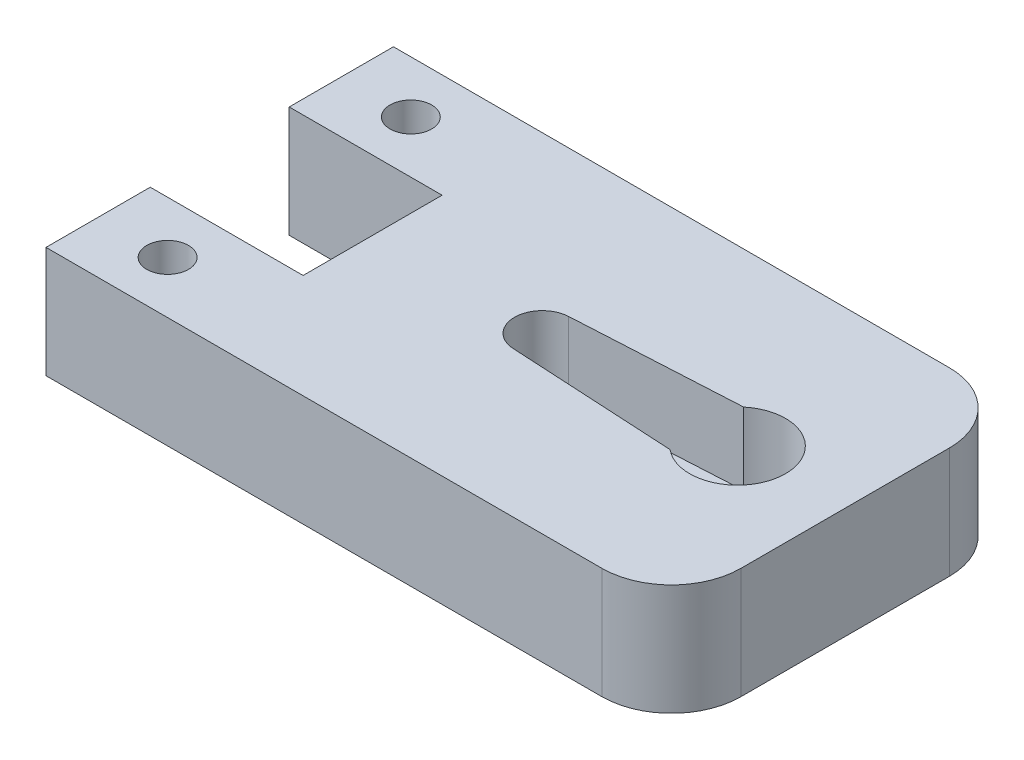
ISO-10303-21;
HEADER;
FILE_DESCRIPTION(('STEP AP214'),'2;1');
FILE_NAME('part.step','',(''),(''),'','','');
FILE_SCHEMA(('AUTOMOTIVE_DESIGN { 1 0 10303 214 1 1 1 1 }'));
ENDSEC;
DATA;
#1=APPLICATION_CONTEXT('core data for automotive mechanical design processes');
#2=APPLICATION_PROTOCOL_DEFINITION('international standard','automotive_design',2000,#1);
#3=PRODUCT_CONTEXT('',#1,'mechanical');
#4=PRODUCT('Part','Part','',(#3));
#5=PRODUCT_RELATED_PRODUCT_CATEGORY('part','',(#4));
#6=PRODUCT_DEFINITION_FORMATION('','',#4);
#7=PRODUCT_DEFINITION_CONTEXT('part definition',#1,'design');
#8=PRODUCT_DEFINITION('design','',#6,#7);
#9=PRODUCT_DEFINITION_SHAPE('','',#8);
#10=(LENGTH_UNIT() NAMED_UNIT(*) SI_UNIT(.MILLI.,.METRE.));
#11=(NAMED_UNIT(*) PLANE_ANGLE_UNIT() SI_UNIT($,.RADIAN.));
#12=(NAMED_UNIT(*) SI_UNIT($,.STERADIAN.) SOLID_ANGLE_UNIT());
#13=UNCERTAINTY_MEASURE_WITH_UNIT(LENGTH_MEASURE(1.E-05),#10,'distance_accuracy_value','');
#14=(GEOMETRIC_REPRESENTATION_CONTEXT(3) GLOBAL_UNCERTAINTY_ASSIGNED_CONTEXT((#13)) GLOBAL_UNIT_ASSIGNED_CONTEXT((#10,
#11,#12)) REPRESENTATION_CONTEXT('',''));
#15=CARTESIAN_POINT('',(0.,0.,0.));
#16=DIRECTION('',(0.,0.,1.));
#17=DIRECTION('',(1.,0.,0.));
#18=AXIS2_PLACEMENT_3D('',#15,#16,#17);
#19=CARTESIAN_POINT('',(0.,8.,-5.00000000000003));
#20=DIRECTION('',(1.,0.,0.));
#21=DIRECTION('',(0.,0.,-1.));
#22=AXIS2_PLACEMENT_3D('',#19,#20,#21);
#23=PLANE('',#22);
#24=DIRECTION('',(0.,0.,1.));
#25=VECTOR('',#24,1.);
#26=CARTESIAN_POINT('',(0.,0.,-5.00000000000003));
#27=LINE('',#26,#25);
#28=CARTESIAN_POINT('',(0.,0.,-25.));
#29=VERTEX_POINT('',#28);
#30=CARTESIAN_POINT('',(0.,0.,-17.5));
#31=VERTEX_POINT('',#30);
#32=EDGE_CURVE('E163',#29,#31,#27,.T.);
#33=ORIENTED_EDGE('',*,*,#32,.T.);
#34=DIRECTION('',(0.,1.,0.));
#35=VECTOR('',#34,1.);
#36=CARTESIAN_POINT('',(0.,0.,-17.5));
#37=LINE('',#36,#35);
#38=CARTESIAN_POINT('',(0.,8.,-17.5));
#39=VERTEX_POINT('',#38);
#40=EDGE_CURVE('E217',#31,#39,#37,.T.);
#41=ORIENTED_EDGE('',*,*,#40,.T.);
#42=DIRECTION('',(0.,0.,1.));
#43=VECTOR('',#42,1.);
#44=CARTESIAN_POINT('',(0.,8.,-25.));
#45=LINE('',#44,#43);
#46=CARTESIAN_POINT('',(0.,8.,-25.));
#47=VERTEX_POINT('',#46);
#48=EDGE_CURVE('E195',#47,#39,#45,.T.);
#49=ORIENTED_EDGE('',*,*,#48,.F.);
#50=DIRECTION('',(0.,-1.,0.));
#51=VECTOR('',#50,1.);
#52=CARTESIAN_POINT('',(0.,8.,-25.));
#53=LINE('',#52,#51);
#54=EDGE_CURVE('E47',#47,#29,#53,.T.);
#55=ORIENTED_EDGE('',*,*,#54,.T.);
#56=EDGE_LOOP('',(#33,#41,#49,#55));
#57=FACE_BOUND('',#56,.T.);
#58=ADVANCED_FACE('F39',(#57),#23,.F.);
#59=CARTESIAN_POINT('',(40.,8.,-20.));
#60=DIRECTION('',(0.,-1.,0.));
#61=DIRECTION('',(0.,0.,-1.));
#62=AXIS2_PLACEMENT_3D('',#59,#60,#61);
#63=CYLINDRICAL_SURFACE('',#62,5.);
#64=CARTESIAN_POINT('',(40.,0.,-20.));
#65=DIRECTION('',(0.,1.,0.));
#66=DIRECTION('',(0.,0.,1.));
#67=AXIS2_PLACEMENT_3D('',#64,#65,#66);
#68=CIRCLE('',#67,5.);
#69=CARTESIAN_POINT('',(45.,0.,-20.));
#70=VERTEX_POINT('',#69);
#71=CARTESIAN_POINT('',(40.,0.,-25.));
#72=VERTEX_POINT('',#71);
#73=EDGE_CURVE('E168',#70,#72,#68,.T.);
#74=ORIENTED_EDGE('',*,*,#73,.T.);
#75=DIRECTION('',(0.,-1.,0.));
#76=VECTOR('',#75,1.);
#77=CARTESIAN_POINT('',(40.,8.,-25.));
#78=LINE('',#77,#76);
#79=CARTESIAN_POINT('',(40.,8.,-25.));
#80=VERTEX_POINT('',#79);
#81=EDGE_CURVE('E11',#80,#72,#78,.T.);
#82=ORIENTED_EDGE('',*,*,#81,.F.);
#83=CARTESIAN_POINT('',(40.,8.,-20.));
#84=DIRECTION('',(0.,1.,0.));
#85=DIRECTION('',(0.,0.,1.));
#86=AXIS2_PLACEMENT_3D('',#83,#84,#85);
#87=CIRCLE('',#86,5.);
#88=CARTESIAN_POINT('',(45.,8.,-20.));
#89=VERTEX_POINT('',#88);
#90=EDGE_CURVE('E177',#89,#80,#87,.T.);
#91=ORIENTED_EDGE('',*,*,#90,.F.);
#92=DIRECTION('',(0.,-1.,0.));
#93=VECTOR('',#92,1.);
#94=CARTESIAN_POINT('',(45.,8.,-20.));
#95=LINE('',#94,#93);
#96=EDGE_CURVE('E178',#89,#70,#95,.T.);
#97=ORIENTED_EDGE('',*,*,#96,.T.);
#98=EDGE_LOOP('',(#74,#82,#91,#97));
#99=FACE_BOUND('',#98,.T.);
#100=ADVANCED_FACE('F41',(#99),#63,.T.);
#101=CARTESIAN_POINT('',(5.00000000000004,8.,-25.));
#102=DIRECTION('',(0.,0.,1.));
#103=DIRECTION('',(1.,0.,0.));
#104=AXIS2_PLACEMENT_3D('',#101,#102,#103);
#105=PLANE('',#104);
#106=DIRECTION('',(-1.,0.,0.));
#107=VECTOR('',#106,1.);
#108=CARTESIAN_POINT('',(5.00000000000004,0.,-25.));
#109=LINE('',#108,#107);
#110=EDGE_CURVE('E164',#72,#29,#109,.T.);
#111=ORIENTED_EDGE('',*,*,#110,.T.);
#112=ORIENTED_EDGE('',*,*,#54,.F.);
#113=DIRECTION('',(-1.,0.,0.));
#114=VECTOR('',#113,1.);
#115=CARTESIAN_POINT('',(5.00000000000004,8.,-25.));
#116=LINE('',#115,#114);
#117=EDGE_CURVE('E198',#80,#47,#116,.T.);
#118=ORIENTED_EDGE('',*,*,#117,.F.);
#119=ORIENTED_EDGE('',*,*,#81,.T.);
#120=EDGE_LOOP('',(#111,#112,#118,#119));
#121=FACE_BOUND('',#120,.T.);
#122=ADVANCED_FACE('F197',(#121),#105,.F.);
#123=CARTESIAN_POINT('',(0.,8.,-7.5));
#124=VERTEX_POINT('',#123);
#125=CARTESIAN_POINT('',(0.,8.,0.));
#126=VERTEX_POINT('',#125);
#127=EDGE_CURVE('E156',#124,#126,#45,.T.);
#128=ORIENTED_EDGE('',*,*,#127,.F.);
#129=DIRECTION('',(0.,1.,0.));
#130=VECTOR('',#129,1.);
#131=CARTESIAN_POINT('',(0.,0.,-7.5));
#132=LINE('',#131,#130);
#133=CARTESIAN_POINT('',(0.,0.,-7.5));
#134=VERTEX_POINT('',#133);
#135=EDGE_CURVE('E143',#134,#124,#132,.T.);
#136=ORIENTED_EDGE('',*,*,#135,.F.);
#137=CARTESIAN_POINT('',(0.,0.,0.));
#138=VERTEX_POINT('',#137);
#139=EDGE_CURVE('E154',#134,#138,#27,.T.);
#140=ORIENTED_EDGE('',*,*,#139,.T.);
#141=DIRECTION('',(0.,-1.,0.));
#142=VECTOR('',#141,1.);
#143=CARTESIAN_POINT('',(0.,8.,0.));
#144=LINE('',#143,#142);
#145=EDGE_CURVE('E188',#126,#138,#144,.T.);
#146=ORIENTED_EDGE('',*,*,#145,.F.);
#147=EDGE_LOOP('',(#128,#136,#140,#146));
#148=FACE_BOUND('',#147,.T.);
#149=ADVANCED_FACE('F152',(#148),#23,.F.);
#150=CARTESIAN_POINT('',(5.00000000000003,8.,0.));
#151=DIRECTION('',(0.,0.,-1.));
#152=DIRECTION('',(-1.,0.,0.));
#153=AXIS2_PLACEMENT_3D('',#150,#151,#152);
#154=PLANE('',#153);
#155=DIRECTION('',(1.,0.,0.));
#156=VECTOR('',#155,1.);
#157=CARTESIAN_POINT('',(5.00000000000003,0.,0.));
#158=LINE('',#157,#156);
#159=CARTESIAN_POINT('',(40.,0.,0.));
#160=VERTEX_POINT('',#159);
#161=EDGE_CURVE('E161',#138,#160,#158,.T.);
#162=ORIENTED_EDGE('',*,*,#161,.T.);
#163=DIRECTION('',(0.,-1.,0.));
#164=VECTOR('',#163,1.);
#165=CARTESIAN_POINT('',(40.,8.,0.));
#166=LINE('',#165,#164);
#167=CARTESIAN_POINT('',(40.,8.,0.));
#168=VERTEX_POINT('',#167);
#169=EDGE_CURVE('E185',#168,#160,#166,.T.);
#170=ORIENTED_EDGE('',*,*,#169,.F.);
#171=DIRECTION('',(1.,0.,0.));
#172=VECTOR('',#171,1.);
#173=CARTESIAN_POINT('',(0.,8.,0.));
#174=LINE('',#173,#172);
#175=EDGE_CURVE('E267',#126,#168,#174,.T.);
#176=ORIENTED_EDGE('',*,*,#175,.F.);
#177=ORIENTED_EDGE('',*,*,#145,.T.);
#178=EDGE_LOOP('',(#162,#170,#176,#177));
#179=FACE_BOUND('',#178,.T.);
#180=ADVANCED_FACE('F284',(#179),#154,.F.);
#181=CARTESIAN_POINT('',(40.,8.,-5.));
#182=DIRECTION('',(0.,-1.,0.));
#183=DIRECTION('',(0.,0.,-1.));
#184=AXIS2_PLACEMENT_3D('',#181,#182,#183);
#185=CYLINDRICAL_SURFACE('',#184,5.);
#186=CARTESIAN_POINT('',(40.,0.,-5.));
#187=DIRECTION('',(0.,1.,0.));
#188=DIRECTION('',(0.,0.,1.));
#189=AXIS2_PLACEMENT_3D('',#186,#187,#188);
#190=CIRCLE('',#189,5.);
#191=CARTESIAN_POINT('',(45.,0.,-5.));
#192=VERTEX_POINT('',#191);
#193=EDGE_CURVE('E173',#160,#192,#190,.T.);
#194=ORIENTED_EDGE('',*,*,#193,.T.);
#195=DIRECTION('',(0.,-1.,0.));
#196=VECTOR('',#195,1.);
#197=CARTESIAN_POINT('',(45.,8.,-5.));
#198=LINE('',#197,#196);
#199=CARTESIAN_POINT('',(45.,8.,-5.));
#200=VERTEX_POINT('',#199);
#201=EDGE_CURVE('E181',#200,#192,#198,.T.);
#202=ORIENTED_EDGE('',*,*,#201,.F.);
#203=CARTESIAN_POINT('',(40.,8.,-5.));
#204=DIRECTION('',(0.,1.,0.));
#205=DIRECTION('',(0.,0.,1.));
#206=AXIS2_PLACEMENT_3D('',#203,#204,#205);
#207=CIRCLE('',#206,5.);
#208=EDGE_CURVE('E269',#168,#200,#207,.T.);
#209=ORIENTED_EDGE('',*,*,#208,.F.);
#210=ORIENTED_EDGE('',*,*,#169,.T.);
#211=EDGE_LOOP('',(#194,#202,#209,#210));
#212=FACE_BOUND('',#211,.T.);
#213=ADVANCED_FACE('F279',(#212),#185,.T.);
#214=CARTESIAN_POINT('',(45.,8.,-5.));
#215=DIRECTION('',(-1.,0.,0.));
#216=DIRECTION('',(0.,0.,1.));
#217=AXIS2_PLACEMENT_3D('',#214,#215,#216);
#218=PLANE('',#217);
#219=DIRECTION('',(0.,0.,-1.));
#220=VECTOR('',#219,1.);
#221=CARTESIAN_POINT('',(45.,0.,-5.));
#222=LINE('',#221,#220);
#223=EDGE_CURVE('E175',#192,#70,#222,.T.);
#224=ORIENTED_EDGE('',*,*,#223,.T.);
#225=ORIENTED_EDGE('',*,*,#96,.F.);
#226=DIRECTION('',(0.,0.,-1.));
#227=VECTOR('',#226,1.);
#228=CARTESIAN_POINT('',(45.,8.,-5.));
#229=LINE('',#228,#227);
#230=EDGE_CURVE('E182',#200,#89,#229,.T.);
#231=ORIENTED_EDGE('',*,*,#230,.F.);
#232=ORIENTED_EDGE('',*,*,#201,.T.);
#233=EDGE_LOOP('',(#224,#225,#231,#232));
#234=FACE_BOUND('',#233,.T.);
#235=ADVANCED_FACE('F276',(#234),#218,.F.);
#236=CARTESIAN_POINT('',(40.,8.,-20.));
#237=DIRECTION('',(0.,1.,0.));
#238=DIRECTION('',(0.,0.,1.));
#239=AXIS2_PLACEMENT_3D('',#236,#237,#238);
#240=PLANE('',#239);
#241=CARTESIAN_POINT('',(5.,8.,-3.75));
#242=DIRECTION('',(0.,1.,0.));
#243=DIRECTION('',(0.,0.,1.));
#244=AXIS2_PLACEMENT_3D('',#241,#242,#243);
#245=CIRCLE('',#244,1.5);
#246=CARTESIAN_POINT('',(5.,8.,-2.25));
#247=VERTEX_POINT('',#246);
#248=EDGE_CURVE('E481',#247,#247,#245,.T.);
#249=ORIENTED_EDGE('',*,*,#248,.F.);
#250=EDGE_LOOP('',(#249));
#251=FACE_BOUND('',#250,.T.);
#252=CARTESIAN_POINT('',(5.,8.,-21.25));
#253=DIRECTION('',(0.,1.,0.));
#254=DIRECTION('',(0.,0.,1.));
#255=AXIS2_PLACEMENT_3D('',#252,#253,#254);
#256=CIRCLE('',#255,1.5);
#257=CARTESIAN_POINT('',(5.,8.,-19.75));
#258=VERTEX_POINT('',#257);
#259=EDGE_CURVE('E213',#258,#258,#256,.T.);
#260=ORIENTED_EDGE('',*,*,#259,.F.);
#261=EDGE_LOOP('',(#260));
#262=FACE_BOUND('',#261,.T.);
#263=DIRECTION('',(-1.,0.,0.));
#264=VECTOR('',#263,1.);
#265=CARTESIAN_POINT('',(0.,8.,-17.5));
#266=LINE('',#265,#264);
#267=CARTESIAN_POINT('',(11.,8.,-17.5));
#268=VERTEX_POINT('',#267);
#269=EDGE_CURVE('E148',#268,#39,#266,.T.);
#270=ORIENTED_EDGE('',*,*,#269,.F.);
#271=DIRECTION('',(0.,0.,-1.));
#272=VECTOR('',#271,1.);
#273=CARTESIAN_POINT('',(11.,8.,-17.5));
#274=LINE('',#273,#272);
#275=CARTESIAN_POINT('',(11.,8.,-7.5));
#276=VERTEX_POINT('',#275);
#277=EDGE_CURVE('E212',#276,#268,#274,.T.);
#278=ORIENTED_EDGE('',*,*,#277,.F.);
#279=DIRECTION('',(1.,0.,0.));
#280=VECTOR('',#279,1.);
#281=CARTESIAN_POINT('',(0.,8.,-7.5));
#282=LINE('',#281,#280);
#283=EDGE_CURVE('E210',#124,#276,#282,.T.);
#284=ORIENTED_EDGE('',*,*,#283,.F.);
#285=ORIENTED_EDGE('',*,*,#127,.T.);
#286=ORIENTED_EDGE('',*,*,#175,.T.);
#287=ORIENTED_EDGE('',*,*,#208,.T.);
#288=ORIENTED_EDGE('',*,*,#230,.T.);
#289=ORIENTED_EDGE('',*,*,#90,.T.);
#290=ORIENTED_EDGE('',*,*,#117,.T.);
#291=ORIENTED_EDGE('',*,*,#48,.T.);
#292=EDGE_LOOP('',(#270,#278,#284,#285,#286,#287,#288,#289,#290,#291));
#293=FACE_BOUND('',#292,.T.);
#294=CARTESIAN_POINT('',(37.26,8.,-12.5));
#295=DIRECTION('',(0.,1.,0.));
#296=DIRECTION('',(0.,0.,1.));
#297=AXIS2_PLACEMENT_3D('',#294,#295,#296);
#298=CIRCLE('',#297,3.45);
#299=CARTESIAN_POINT('',(35.0509277965625,8.,-9.85));
#300=VERTEX_POINT('',#299);
#301=CARTESIAN_POINT('',(35.0509277965625,8.,-15.15));
#302=VERTEX_POINT('',#301);
#303=EDGE_CURVE('E62',#300,#302,#298,.T.);
#304=ORIENTED_EDGE('',*,*,#303,.F.);
#305=DIRECTION('',(0.998510440144325,0.,0.0545609835210725));
#306=VECTOR('',#305,1.);
#307=CARTESIAN_POINT('',(35.0509277965625,8.,-9.85));
#308=LINE('',#307,#306);
#309=CARTESIAN_POINT('',(23.1008780329579,8.,-10.5029791197114));
#310=VERTEX_POINT('',#309);
#311=EDGE_CURVE('E238',#310,#300,#308,.T.);
#312=ORIENTED_EDGE('',*,*,#311,.F.);
#313=CARTESIAN_POINT('',(23.21,8.,-12.5));
#314=DIRECTION('',(0.,1.,0.));
#315=DIRECTION('',(0.,0.,1.));
#316=AXIS2_PLACEMENT_3D('',#313,#314,#315);
#317=CIRCLE('',#316,2.);
#318=CARTESIAN_POINT('',(23.1008780329579,8.,-14.4970208802886));
#319=VERTEX_POINT('',#318);
#320=EDGE_CURVE('E252',#319,#310,#317,.T.);
#321=ORIENTED_EDGE('',*,*,#320,.F.);
#322=DIRECTION('',(-0.998510440144325,0.,0.0545609835210727));
#323=VECTOR('',#322,1.);
#324=CARTESIAN_POINT('',(35.0509277965625,8.,-15.15));
#325=LINE('',#324,#323);
#326=EDGE_CURVE('E249',#302,#319,#325,.T.);
#327=ORIENTED_EDGE('',*,*,#326,.F.);
#328=EDGE_LOOP('',(#304,#312,#321,#327));
#329=FACE_BOUND('',#328,.T.);
#330=ADVANCED_FACE('F287',(#251,#262,#293,#329),#240,.T.);
#331=CARTESIAN_POINT('',(40.,0.,-20.));
#332=DIRECTION('',(0.,1.,0.));
#333=DIRECTION('',(0.,0.,1.));
#334=AXIS2_PLACEMENT_3D('',#331,#332,#333);
#335=PLANE('',#334);
#336=CARTESIAN_POINT('',(5.,0.,-3.75));
#337=DIRECTION('',(0.,1.,0.));
#338=DIRECTION('',(0.,0.,1.));
#339=AXIS2_PLACEMENT_3D('',#336,#337,#338);
#340=CIRCLE('',#339,1.5);
#341=CARTESIAN_POINT('',(5.,0.,-2.25));
#342=VERTEX_POINT('',#341);
#343=EDGE_CURVE('E477',#342,#342,#340,.T.);
#344=ORIENTED_EDGE('',*,*,#343,.T.);
#345=EDGE_LOOP('',(#344));
#346=FACE_BOUND('',#345,.T.);
#347=CARTESIAN_POINT('',(5.,0.,-21.25));
#348=DIRECTION('',(0.,1.,0.));
#349=DIRECTION('',(0.,0.,1.));
#350=AXIS2_PLACEMENT_3D('',#347,#348,#349);
#351=CIRCLE('',#350,1.5);
#352=CARTESIAN_POINT('',(5.,0.,-19.75));
#353=VERTEX_POINT('',#352);
#354=EDGE_CURVE('E488',#353,#353,#351,.T.);
#355=ORIENTED_EDGE('',*,*,#354,.T.);
#356=EDGE_LOOP('',(#355));
#357=FACE_BOUND('',#356,.T.);
#358=CARTESIAN_POINT('',(37.26,0.,-12.5));
#359=DIRECTION('',(0.,1.,0.));
#360=DIRECTION('',(0.,0.,1.));
#361=AXIS2_PLACEMENT_3D('',#358,#359,#360);
#362=CIRCLE('',#361,1.25);
#363=CARTESIAN_POINT('',(37.26,0.,-11.25));
#364=VERTEX_POINT('',#363);
#365=EDGE_CURVE('E223',#364,#364,#362,.T.);
#366=ORIENTED_EDGE('',*,*,#365,.T.);
#367=EDGE_LOOP('',(#366));
#368=FACE_BOUND('',#367,.T.);
#369=DIRECTION('',(0.,0.,-1.));
#370=VECTOR('',#369,1.);
#371=CARTESIAN_POINT('',(11.,0.,-17.5));
#372=LINE('',#371,#370);
#373=CARTESIAN_POINT('',(11.,0.,-7.5));
#374=VERTEX_POINT('',#373);
#375=CARTESIAN_POINT('',(11.,0.,-17.5));
#376=VERTEX_POINT('',#375);
#377=EDGE_CURVE('E54',#374,#376,#372,.T.);
#378=ORIENTED_EDGE('',*,*,#377,.T.);
#379=DIRECTION('',(-1.,0.,0.));
#380=VECTOR('',#379,1.);
#381=CARTESIAN_POINT('',(0.,0.,-17.5));
#382=LINE('',#381,#380);
#383=EDGE_CURVE('E157',#376,#31,#382,.T.);
#384=ORIENTED_EDGE('',*,*,#383,.T.);
#385=ORIENTED_EDGE('',*,*,#32,.F.);
#386=ORIENTED_EDGE('',*,*,#110,.F.);
#387=ORIENTED_EDGE('',*,*,#73,.F.);
#388=ORIENTED_EDGE('',*,*,#223,.F.);
#389=ORIENTED_EDGE('',*,*,#193,.F.);
#390=ORIENTED_EDGE('',*,*,#161,.F.);
#391=ORIENTED_EDGE('',*,*,#139,.F.);
#392=DIRECTION('',(1.,0.,0.));
#393=VECTOR('',#392,1.);
#394=CARTESIAN_POINT('',(0.,0.,-7.5));
#395=LINE('',#394,#393);
#396=EDGE_CURVE('E139',#134,#374,#395,.T.);
#397=ORIENTED_EDGE('',*,*,#396,.T.);
#398=EDGE_LOOP('',(#378,#384,#385,#386,#387,#388,#389,#390,#391,#397));
#399=FACE_BOUND('',#398,.T.);
#400=ADVANCED_FACE('F159',(#346,#357,#368,#399),#335,.F.);
#401=CARTESIAN_POINT('',(37.26,2.8,-12.5));
#402=DIRECTION('',(0.,1.,0.));
#403=DIRECTION('',(0.,0.,1.));
#404=AXIS2_PLACEMENT_3D('',#401,#402,#403);
#405=CYLINDRICAL_SURFACE('',#404,3.45);
#406=ORIENTED_EDGE('',*,*,#303,.T.);
#407=DIRECTION('',(0.,1.,0.));
#408=VECTOR('',#407,1.);
#409=CARTESIAN_POINT('',(35.0509277965625,2.8,-15.15));
#410=LINE('',#409,#408);
#411=CARTESIAN_POINT('',(35.0509277965625,2.8,-15.15));
#412=VERTEX_POINT('',#411);
#413=EDGE_CURVE('E247',#412,#302,#410,.T.);
#414=ORIENTED_EDGE('',*,*,#413,.F.);
#415=CARTESIAN_POINT('',(37.26,2.8,-12.5));
#416=DIRECTION('',(0.,1.,0.));
#417=DIRECTION('',(0.,0.,1.));
#418=AXIS2_PLACEMENT_3D('',#415,#416,#417);
#419=CIRCLE('',#418,3.45);
#420=CARTESIAN_POINT('',(35.0509277965625,2.8,-9.85));
#421=VERTEX_POINT('',#420);
#422=EDGE_CURVE('E234',#421,#412,#419,.T.);
#423=ORIENTED_EDGE('',*,*,#422,.F.);
#424=DIRECTION('',(0.,1.,0.));
#425=VECTOR('',#424,1.);
#426=CARTESIAN_POINT('',(35.0509277965625,2.8,-9.85));
#427=LINE('',#426,#425);
#428=EDGE_CURVE('E257',#421,#300,#427,.T.);
#429=ORIENTED_EDGE('',*,*,#428,.T.);
#430=EDGE_LOOP('',(#406,#414,#423,#429));
#431=FACE_BOUND('',#430,.T.);
#432=ADVANCED_FACE('F346',(#431),#405,.F.);
#433=CARTESIAN_POINT('',(35.0509277965625,2.8,-9.85));
#434=DIRECTION('',(-0.0545609835210725,0.,0.998510440144325));
#435=DIRECTION('',(0.998510440144325,0.,0.0545609835210725));
#436=AXIS2_PLACEMENT_3D('',#433,#434,#435);
#437=PLANE('',#436);
#438=ORIENTED_EDGE('',*,*,#311,.T.);
#439=ORIENTED_EDGE('',*,*,#428,.F.);
#440=DIRECTION('',(0.998510440144325,0.,0.0545609835210725));
#441=VECTOR('',#440,1.);
#442=CARTESIAN_POINT('',(35.0509277965625,2.8,-9.85));
#443=LINE('',#442,#441);
#444=CARTESIAN_POINT('',(23.1008780329579,2.8,-10.5029791197114));
#445=VERTEX_POINT('',#444);
#446=EDGE_CURVE('E244',#445,#421,#443,.T.);
#447=ORIENTED_EDGE('',*,*,#446,.F.);
#448=DIRECTION('',(0.,1.,0.));
#449=VECTOR('',#448,1.);
#450=CARTESIAN_POINT('',(23.1008780329579,2.8,-10.5029791197114));
#451=LINE('',#450,#449);
#452=EDGE_CURVE('E259',#445,#310,#451,.T.);
#453=ORIENTED_EDGE('',*,*,#452,.T.);
#454=EDGE_LOOP('',(#438,#439,#447,#453));
#455=FACE_BOUND('',#454,.T.);
#456=ADVANCED_FACE('F350',(#455),#437,.F.);
#457=CARTESIAN_POINT('',(23.21,2.8,-12.5));
#458=DIRECTION('',(0.,1.,0.));
#459=DIRECTION('',(0.,0.,1.));
#460=AXIS2_PLACEMENT_3D('',#457,#458,#459);
#461=CYLINDRICAL_SURFACE('',#460,2.);
#462=ORIENTED_EDGE('',*,*,#320,.T.);
#463=ORIENTED_EDGE('',*,*,#452,.F.);
#464=CARTESIAN_POINT('',(23.21,2.8,-12.5));
#465=DIRECTION('',(0.,1.,0.));
#466=DIRECTION('',(0.,0.,1.));
#467=AXIS2_PLACEMENT_3D('',#464,#465,#466);
#468=CIRCLE('',#467,2.);
#469=CARTESIAN_POINT('',(23.1008780329579,2.8,-14.4970208802886));
#470=VERTEX_POINT('',#469);
#471=EDGE_CURVE('E241',#470,#445,#468,.T.);
#472=ORIENTED_EDGE('',*,*,#471,.F.);
#473=DIRECTION('',(0.,1.,0.));
#474=VECTOR('',#473,1.);
#475=CARTESIAN_POINT('',(23.1008780329579,2.8,-14.4970208802886));
#476=LINE('',#475,#474);
#477=EDGE_CURVE('E261',#470,#319,#476,.T.);
#478=ORIENTED_EDGE('',*,*,#477,.T.);
#479=EDGE_LOOP('',(#462,#463,#472,#478));
#480=FACE_BOUND('',#479,.T.);
#481=ADVANCED_FACE('F359',(#480),#461,.F.);
#482=CARTESIAN_POINT('',(35.0509277965625,2.8,-15.15));
#483=DIRECTION('',(-0.0545609835210727,0.,-0.998510440144325));
#484=DIRECTION('',(-0.998510440144325,0.,0.0545609835210727));
#485=AXIS2_PLACEMENT_3D('',#482,#483,#484);
#486=PLANE('',#485);
#487=ORIENTED_EDGE('',*,*,#326,.T.);
#488=ORIENTED_EDGE('',*,*,#477,.F.);
#489=DIRECTION('',(-0.998510440144325,0.,0.0545609835210727));
#490=VECTOR('',#489,1.);
#491=CARTESIAN_POINT('',(35.0509277965625,2.8,-15.15));
#492=LINE('',#491,#490);
#493=EDGE_CURVE('E237',#412,#470,#492,.T.);
#494=ORIENTED_EDGE('',*,*,#493,.F.);
#495=ORIENTED_EDGE('',*,*,#413,.T.);
#496=EDGE_LOOP('',(#487,#488,#494,#495));
#497=FACE_BOUND('',#496,.T.);
#498=ADVANCED_FACE('F368',(#497),#486,.F.);
#499=CARTESIAN_POINT('',(37.26,2.8,-12.5));
#500=DIRECTION('',(0.,1.,0.));
#501=DIRECTION('',(0.,0.,1.));
#502=AXIS2_PLACEMENT_3D('',#499,#500,#501);
#503=PLANE('',#502);
#504=CARTESIAN_POINT('',(22.81,2.8,-12.5));
#505=DIRECTION('',(0.,1.,0.));
#506=DIRECTION('',(0.,0.,1.));
#507=AXIS2_PLACEMENT_3D('',#504,#505,#506);
#508=CIRCLE('',#507,0.6);
#509=CARTESIAN_POINT('',(22.81,2.8,-11.9));
#510=VERTEX_POINT('',#509);
#511=EDGE_CURVE('E478',#510,#510,#508,.T.);
#512=ORIENTED_EDGE('',*,*,#511,.F.);
#513=EDGE_LOOP('',(#512));
#514=FACE_BOUND('',#513,.T.);
#515=CARTESIAN_POINT('',(37.26,2.8,-12.5));
#516=DIRECTION('',(0.,1.,0.));
#517=DIRECTION('',(0.,0.,1.));
#518=AXIS2_PLACEMENT_3D('',#515,#516,#517);
#519=CIRCLE('',#518,2.3);
#520=CARTESIAN_POINT('',(37.26,2.8,-10.2));
#521=VERTEX_POINT('',#520);
#522=EDGE_CURVE('E226',#521,#521,#519,.T.);
#523=ORIENTED_EDGE('',*,*,#522,.F.);
#524=EDGE_LOOP('',(#523));
#525=FACE_BOUND('',#524,.T.);
#526=ORIENTED_EDGE('',*,*,#422,.T.);
#527=ORIENTED_EDGE('',*,*,#493,.T.);
#528=ORIENTED_EDGE('',*,*,#471,.T.);
#529=ORIENTED_EDGE('',*,*,#446,.T.);
#530=EDGE_LOOP('',(#526,#527,#528,#529));
#531=FACE_BOUND('',#530,.T.);
#532=ADVANCED_FACE('F377',(#514,#525,#531),#503,.T.);
#533=CARTESIAN_POINT('',(37.26,3.8,-12.5));
#534=DIRECTION('',(0.,-1.,0.));
#535=DIRECTION('',(0.,0.,-1.));
#536=AXIS2_PLACEMENT_3D('',#533,#534,#535);
#537=CYLINDRICAL_SURFACE('',#536,2.3);
#538=CARTESIAN_POINT('',(37.26,3.8,-12.5));
#539=DIRECTION('',(0.,1.,0.));
#540=DIRECTION('',(0.,0.,1.));
#541=AXIS2_PLACEMENT_3D('',#538,#539,#540);
#542=CIRCLE('',#541,2.3);
#543=CARTESIAN_POINT('',(37.26,3.8,-10.2));
#544=VERTEX_POINT('',#543);
#545=EDGE_CURVE('E229',#544,#544,#542,.T.);
#546=ORIENTED_EDGE('',*,*,#545,.F.);
#547=EDGE_LOOP('',(#546));
#548=FACE_BOUND('',#547,.T.);
#549=ORIENTED_EDGE('',*,*,#522,.T.);
#550=EDGE_LOOP('',(#549));
#551=FACE_BOUND('',#550,.T.);
#552=ADVANCED_FACE('F384',(#548,#551),#537,.T.);
#553=CARTESIAN_POINT('',(37.26,3.8,-12.5));
#554=DIRECTION('',(0.,1.,0.));
#555=DIRECTION('',(0.,0.,1.));
#556=AXIS2_PLACEMENT_3D('',#553,#554,#555);
#557=PLANE('',#556);
#558=CARTESIAN_POINT('',(37.26,3.8,-12.5));
#559=DIRECTION('',(0.,1.,0.));
#560=DIRECTION('',(0.,0.,1.));
#561=AXIS2_PLACEMENT_3D('',#558,#559,#560);
#562=CIRCLE('',#561,1.25);
#563=CARTESIAN_POINT('',(37.26,3.8,-11.25));
#564=VERTEX_POINT('',#563);
#565=EDGE_CURVE('E219',#564,#564,#562,.T.);
#566=ORIENTED_EDGE('',*,*,#565,.F.);
#567=EDGE_LOOP('',(#566));
#568=FACE_BOUND('',#567,.T.);
#569=ORIENTED_EDGE('',*,*,#545,.T.);
#570=EDGE_LOOP('',(#569));
#571=FACE_BOUND('',#570,.T.);
#572=ADVANCED_FACE('F301',(#568,#571),#557,.T.);
#573=CARTESIAN_POINT('',(37.26,0.,-12.5));
#574=DIRECTION('',(0.,1.,0.));
#575=DIRECTION('',(0.,0.,1.));
#576=AXIS2_PLACEMENT_3D('',#573,#574,#575);
#577=CYLINDRICAL_SURFACE('',#576,1.25);
#578=ORIENTED_EDGE('',*,*,#365,.F.);
#579=EDGE_LOOP('',(#578));
#580=FACE_BOUND('',#579,.T.);
#581=ORIENTED_EDGE('',*,*,#565,.T.);
#582=EDGE_LOOP('',(#581));
#583=FACE_BOUND('',#582,.T.);
#584=ADVANCED_FACE('F293',(#580,#583),#577,.F.);
#585=CARTESIAN_POINT('',(0.,0.,-17.5));
#586=DIRECTION('',(0.,0.,-1.));
#587=DIRECTION('',(-1.,0.,0.));
#588=AXIS2_PLACEMENT_3D('',#585,#586,#587);
#589=PLANE('',#588);
#590=ORIENTED_EDGE('',*,*,#269,.T.);
#591=ORIENTED_EDGE('',*,*,#40,.F.);
#592=ORIENTED_EDGE('',*,*,#383,.F.);
#593=DIRECTION('',(0.,1.,0.));
#594=VECTOR('',#593,1.);
#595=CARTESIAN_POINT('',(11.,0.,-17.5));
#596=LINE('',#595,#594);
#597=EDGE_CURVE('E220',#376,#268,#596,.T.);
#598=ORIENTED_EDGE('',*,*,#597,.T.);
#599=EDGE_LOOP('',(#590,#591,#592,#598));
#600=FACE_BOUND('',#599,.T.);
#601=ADVANCED_FACE('F291',(#600),#589,.F.);
#602=CARTESIAN_POINT('',(11.,0.,-17.5));
#603=DIRECTION('',(1.,0.,0.));
#604=DIRECTION('',(0.,0.,-1.));
#605=AXIS2_PLACEMENT_3D('',#602,#603,#604);
#606=PLANE('',#605);
#607=ORIENTED_EDGE('',*,*,#277,.T.);
#608=ORIENTED_EDGE('',*,*,#597,.F.);
#609=ORIENTED_EDGE('',*,*,#377,.F.);
#610=DIRECTION('',(0.,1.,0.));
#611=VECTOR('',#610,1.);
#612=CARTESIAN_POINT('',(11.,0.,-7.5));
#613=LINE('',#612,#611);
#614=EDGE_CURVE('E145',#374,#276,#613,.T.);
#615=ORIENTED_EDGE('',*,*,#614,.T.);
#616=EDGE_LOOP('',(#607,#608,#609,#615));
#617=FACE_BOUND('',#616,.T.);
#618=ADVANCED_FACE('F290',(#617),#606,.F.);
#619=CARTESIAN_POINT('',(0.,0.,-7.5));
#620=DIRECTION('',(0.,0.,1.));
#621=DIRECTION('',(1.,0.,0.));
#622=AXIS2_PLACEMENT_3D('',#619,#620,#621);
#623=PLANE('',#622);
#624=ORIENTED_EDGE('',*,*,#283,.T.);
#625=ORIENTED_EDGE('',*,*,#614,.F.);
#626=ORIENTED_EDGE('',*,*,#396,.F.);
#627=ORIENTED_EDGE('',*,*,#135,.T.);
#628=EDGE_LOOP('',(#624,#625,#626,#627));
#629=FACE_BOUND('',#628,.T.);
#630=ADVANCED_FACE('F142',(#629),#623,.F.);
#631=CARTESIAN_POINT('',(5.,0.,-21.25));
#632=DIRECTION('',(0.,1.,0.));
#633=DIRECTION('',(0.,0.,1.));
#634=AXIS2_PLACEMENT_3D('',#631,#632,#633);
#635=CYLINDRICAL_SURFACE('',#634,1.5);
#636=ORIENTED_EDGE('',*,*,#354,.F.);
#637=EDGE_LOOP('',(#636));
#638=FACE_BOUND('',#637,.T.);
#639=ORIENTED_EDGE('',*,*,#259,.T.);
#640=EDGE_LOOP('',(#639));
#641=FACE_BOUND('',#640,.T.);
#642=ADVANCED_FACE('F432',(#638,#641),#635,.F.);
#643=CARTESIAN_POINT('',(5.,0.,-3.75));
#644=DIRECTION('',(0.,1.,0.));
#645=DIRECTION('',(0.,0.,1.));
#646=AXIS2_PLACEMENT_3D('',#643,#644,#645);
#647=CYLINDRICAL_SURFACE('',#646,1.5);
#648=ORIENTED_EDGE('',*,*,#343,.F.);
#649=EDGE_LOOP('',(#648));
#650=FACE_BOUND('',#649,.T.);
#651=ORIENTED_EDGE('',*,*,#248,.T.);
#652=EDGE_LOOP('',(#651));
#653=FACE_BOUND('',#652,.T.);
#654=ADVANCED_FACE('F441',(#650,#653),#647,.F.);
#655=CARTESIAN_POINT('',(22.81,4.,-12.5));
#656=DIRECTION('',(0.,-1.,0.));
#657=DIRECTION('',(0.,0.,-1.));
#658=AXIS2_PLACEMENT_3D('',#655,#656,#657);
#659=CYLINDRICAL_SURFACE('',#658,0.6);
#660=CARTESIAN_POINT('',(22.81,4.,-12.5));
#661=DIRECTION('',(0.,1.,0.));
#662=DIRECTION('',(0.,0.,1.));
#663=AXIS2_PLACEMENT_3D('',#660,#661,#662);
#664=CIRCLE('',#663,0.6);
#665=CARTESIAN_POINT('',(22.81,4.,-11.9));
#666=VERTEX_POINT('',#665);
#667=EDGE_CURVE('E476',#666,#666,#664,.T.);
#668=ORIENTED_EDGE('',*,*,#667,.F.);
#669=EDGE_LOOP('',(#668));
#670=FACE_BOUND('',#669,.T.);
#671=ORIENTED_EDGE('',*,*,#511,.T.);
#672=EDGE_LOOP('',(#671));
#673=FACE_BOUND('',#672,.T.);
#674=ADVANCED_FACE('F451',(#670,#673),#659,.T.);
#675=CARTESIAN_POINT('',(22.81,4.,-12.5));
#676=DIRECTION('',(0.,1.,0.));
#677=DIRECTION('',(0.,0.,1.));
#678=AXIS2_PLACEMENT_3D('',#675,#676,#677);
#679=PLANE('',#678);
#680=ORIENTED_EDGE('',*,*,#667,.T.);
#681=EDGE_LOOP('',(#680));
#682=FACE_BOUND('',#681,.T.);
#683=ADVANCED_FACE('F461',(#682),#679,.T.);
#684=CLOSED_SHELL('',(#58,#100,#122,#149,#180,#213,#235,#330,#400,#432,#456,#481,#498,#532,#552,
#572,#584,#601,#618,#630,#642,#654,#674,#683));
#685=MANIFOLD_SOLID_BREP('B2',#684);
#686=ADVANCED_BREP_SHAPE_REPRESENTATION('',(#18,#685),#14);
#687=SHAPE_DEFINITION_REPRESENTATION(#9,#686);
ENDSEC;
END-ISO-10303-21;
